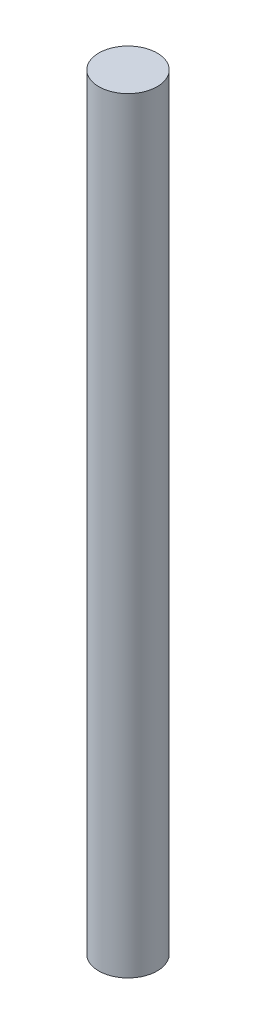
ISO-10303-21;
HEADER;
FILE_DESCRIPTION(('STEP AP214'),'2;1');
FILE_NAME('part.step','',(''),(''),'','','');
FILE_SCHEMA(('AUTOMOTIVE_DESIGN { 1 0 10303 214 1 1 1 1 }'));
ENDSEC;
DATA;
#1=APPLICATION_CONTEXT('core data for automotive mechanical design processes');
#2=APPLICATION_PROTOCOL_DEFINITION('international standard','automotive_design',2000,#1);
#3=PRODUCT_CONTEXT('',#1,'mechanical');
#4=PRODUCT('Part','Part','',(#3));
#5=PRODUCT_RELATED_PRODUCT_CATEGORY('part','',(#4));
#6=PRODUCT_DEFINITION_FORMATION('','',#4);
#7=PRODUCT_DEFINITION_CONTEXT('part definition',#1,'design');
#8=PRODUCT_DEFINITION('design','',#6,#7);
#9=PRODUCT_DEFINITION_SHAPE('','',#8);
#10=(LENGTH_UNIT() NAMED_UNIT(*) SI_UNIT(.MILLI.,.METRE.));
#11=(NAMED_UNIT(*) PLANE_ANGLE_UNIT() SI_UNIT($,.RADIAN.));
#12=(NAMED_UNIT(*) SI_UNIT($,.STERADIAN.) SOLID_ANGLE_UNIT());
#13=UNCERTAINTY_MEASURE_WITH_UNIT(LENGTH_MEASURE(1.E-05),#10,'distance_accuracy_value','');
#14=(GEOMETRIC_REPRESENTATION_CONTEXT(3) GLOBAL_UNCERTAINTY_ASSIGNED_CONTEXT((#13)) GLOBAL_UNIT_ASSIGNED_CONTEXT((#10,
#11,#12)) REPRESENTATION_CONTEXT('',''));
#15=CARTESIAN_POINT('',(0.,0.,0.));
#16=DIRECTION('',(0.,0.,1.));
#17=DIRECTION('',(1.,0.,0.));
#18=AXIS2_PLACEMENT_3D('',#15,#16,#17);
#19=CARTESIAN_POINT('',(140.,-105.,0.));
#20=DIRECTION('',(0.,1.,0.));
#21=DIRECTION('',(0.,0.,1.));
#22=AXIS2_PLACEMENT_3D('',#19,#20,#21);
#23=CYLINDRICAL_SURFACE('',#22,4.);
#24=CARTESIAN_POINT('',(140.,-105.,0.));
#25=DIRECTION('',(0.,1.,0.));
#26=DIRECTION('',(0.,0.,1.));
#27=AXIS2_PLACEMENT_3D('',#24,#25,#26);
#28=CIRCLE('',#27,4.);
#29=CARTESIAN_POINT('',(140.,-105.,4.));
#30=VERTEX_POINT('',#29);
#31=EDGE_CURVE('E10',#30,#30,#28,.T.);
#32=ORIENTED_EDGE('',*,*,#31,.T.);
#33=EDGE_LOOP('',(#32));
#34=FACE_BOUND('',#33,.T.);
#35=CARTESIAN_POINT('',(140.,0.,0.));
#36=DIRECTION('',(0.,1.,0.));
#37=DIRECTION('',(0.,0.,1.));
#38=AXIS2_PLACEMENT_3D('',#35,#36,#37);
#39=CIRCLE('',#38,4.);
#40=CARTESIAN_POINT('',(140.,0.,4.));
#41=VERTEX_POINT('',#40);
#42=EDGE_CURVE('E37',#41,#41,#39,.T.);
#43=ORIENTED_EDGE('',*,*,#42,.F.);
#44=EDGE_LOOP('',(#43));
#45=FACE_BOUND('',#44,.T.);
#46=ADVANCED_FACE('F31',(#34,#45),#23,.T.);
#47=CARTESIAN_POINT('',(144.,-105.,0.));
#48=DIRECTION('',(0.,-1.,0.));
#49=DIRECTION('',(0.,0.,-1.));
#50=AXIS2_PLACEMENT_3D('',#47,#48,#49);
#51=PLANE('',#50);
#52=ORIENTED_EDGE('',*,*,#31,.F.);
#53=EDGE_LOOP('',(#52));
#54=FACE_BOUND('',#53,.T.);
#55=ADVANCED_FACE('F46',(#54),#51,.T.);
#56=CARTESIAN_POINT('',(140.,0.,0.));
#57=DIRECTION('',(0.,1.,0.));
#58=DIRECTION('',(0.,0.,1.));
#59=AXIS2_PLACEMENT_3D('',#56,#57,#58);
#60=PLANE('',#59);
#61=ORIENTED_EDGE('',*,*,#42,.T.);
#62=EDGE_LOOP('',(#61));
#63=FACE_BOUND('',#62,.T.);
#64=ADVANCED_FACE('F43',(#63),#60,.T.);
#65=CLOSED_SHELL('',(#46,#55,#64));
#66=MANIFOLD_SOLID_BREP('B2',#65);
#67=ADVANCED_BREP_SHAPE_REPRESENTATION('',(#18,#66),#14);
#68=SHAPE_DEFINITION_REPRESENTATION(#9,#67);
ENDSEC;
END-ISO-10303-21;
